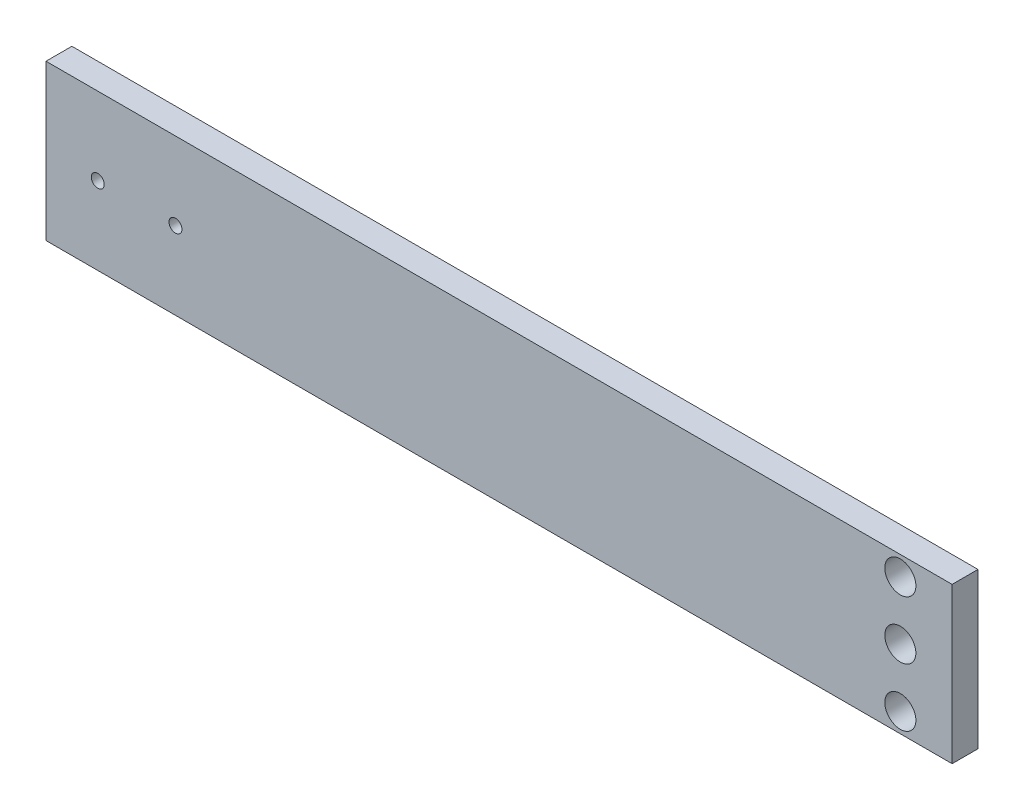
ISO-10303-21;
HEADER;
FILE_DESCRIPTION(('STEP AP214'),'2;1');
FILE_NAME('part.step','',(''),(''),'','','');
FILE_SCHEMA(('AUTOMOTIVE_DESIGN { 1 0 10303 214 1 1 1 1 }'));
ENDSEC;
DATA;
#1=APPLICATION_CONTEXT('core data for automotive mechanical design processes');
#2=APPLICATION_PROTOCOL_DEFINITION('international standard','automotive_design',2000,#1);
#3=PRODUCT_CONTEXT('',#1,'mechanical');
#4=PRODUCT('Part','Part','',(#3));
#5=PRODUCT_RELATED_PRODUCT_CATEGORY('part','',(#4));
#6=PRODUCT_DEFINITION_FORMATION('','',#4);
#7=PRODUCT_DEFINITION_CONTEXT('part definition',#1,'design');
#8=PRODUCT_DEFINITION('design','',#6,#7);
#9=PRODUCT_DEFINITION_SHAPE('','',#8);
#10=(LENGTH_UNIT() NAMED_UNIT(*) SI_UNIT(.MILLI.,.METRE.));
#11=(NAMED_UNIT(*) PLANE_ANGLE_UNIT() SI_UNIT($,.RADIAN.));
#12=(NAMED_UNIT(*) SI_UNIT($,.STERADIAN.) SOLID_ANGLE_UNIT());
#13=UNCERTAINTY_MEASURE_WITH_UNIT(LENGTH_MEASURE(1.E-05),#10,'distance_accuracy_value','');
#14=(GEOMETRIC_REPRESENTATION_CONTEXT(3) GLOBAL_UNCERTAINTY_ASSIGNED_CONTEXT((#13)) GLOBAL_UNIT_ASSIGNED_CONTEXT((#10,
#11,#12)) REPRESENTATION_CONTEXT('',''));
#15=CARTESIAN_POINT('',(0.,0.,0.));
#16=DIRECTION('',(0.,0.,1.));
#17=DIRECTION('',(1.,0.,0.));
#18=AXIS2_PLACEMENT_3D('',#15,#16,#17);
#19=CARTESIAN_POINT('',(175.,30.,10.));
#20=DIRECTION('',(-1.,0.,0.));
#21=DIRECTION('',(0.,0.,1.));
#22=AXIS2_PLACEMENT_3D('',#19,#20,#21);
#23=PLANE('',#22);
#24=DIRECTION('',(0.,1.,0.));
#25=VECTOR('',#24,1.);
#26=CARTESIAN_POINT('',(175.,30.,0.));
#27=LINE('',#26,#25);
#28=CARTESIAN_POINT('',(175.,-30.,0.));
#29=VERTEX_POINT('',#28);
#30=CARTESIAN_POINT('',(175.,30.,0.));
#31=VERTEX_POINT('',#30);
#32=EDGE_CURVE('E111',#29,#31,#27,.T.);
#33=ORIENTED_EDGE('',*,*,#32,.T.);
#34=DIRECTION('',(0.,0.,-1.));
#35=VECTOR('',#34,1.);
#36=CARTESIAN_POINT('',(175.,30.,10.));
#37=LINE('',#36,#35);
#38=CARTESIAN_POINT('',(175.,30.,10.));
#39=VERTEX_POINT('',#38);
#40=EDGE_CURVE('E11',#39,#31,#37,.T.);
#41=ORIENTED_EDGE('',*,*,#40,.F.);
#42=DIRECTION('',(0.,1.,0.));
#43=VECTOR('',#42,1.);
#44=CARTESIAN_POINT('',(175.,30.,10.));
#45=LINE('',#44,#43);
#46=CARTESIAN_POINT('',(175.,-30.,10.));
#47=VERTEX_POINT('',#46);
#48=EDGE_CURVE('E95',#47,#39,#45,.T.);
#49=ORIENTED_EDGE('',*,*,#48,.F.);
#50=DIRECTION('',(0.,0.,-1.));
#51=VECTOR('',#50,1.);
#52=CARTESIAN_POINT('',(175.,-30.,10.));
#53=LINE('',#52,#51);
#54=EDGE_CURVE('E107',#47,#29,#53,.T.);
#55=ORIENTED_EDGE('',*,*,#54,.T.);
#56=EDGE_LOOP('',(#33,#41,#49,#55));
#57=FACE_BOUND('',#56,.T.);
#58=ADVANCED_FACE('F43',(#57),#23,.F.);
#59=CARTESIAN_POINT('',(-175.,30.,10.));
#60=DIRECTION('',(0.,-1.,0.));
#61=DIRECTION('',(0.,0.,-1.));
#62=AXIS2_PLACEMENT_3D('',#59,#60,#61);
#63=PLANE('',#62);
#64=DIRECTION('',(-1.,0.,0.));
#65=VECTOR('',#64,1.);
#66=CARTESIAN_POINT('',(-175.,30.,0.));
#67=LINE('',#66,#65);
#68=CARTESIAN_POINT('',(-175.,30.,0.));
#69=VERTEX_POINT('',#68);
#70=EDGE_CURVE('E100',#31,#69,#67,.T.);
#71=ORIENTED_EDGE('',*,*,#70,.T.);
#72=DIRECTION('',(0.,0.,-1.));
#73=VECTOR('',#72,1.);
#74=CARTESIAN_POINT('',(-175.,30.,10.));
#75=LINE('',#74,#73);
#76=CARTESIAN_POINT('',(-175.,30.,10.));
#77=VERTEX_POINT('',#76);
#78=EDGE_CURVE('E52',#77,#69,#75,.T.);
#79=ORIENTED_EDGE('',*,*,#78,.F.);
#80=DIRECTION('',(-1.,0.,0.));
#81=VECTOR('',#80,1.);
#82=CARTESIAN_POINT('',(-175.,30.,10.));
#83=LINE('',#82,#81);
#84=EDGE_CURVE('E90',#39,#77,#83,.T.);
#85=ORIENTED_EDGE('',*,*,#84,.F.);
#86=ORIENTED_EDGE('',*,*,#40,.T.);
#87=EDGE_LOOP('',(#71,#79,#85,#86));
#88=FACE_BOUND('',#87,.T.);
#89=ADVANCED_FACE('F99',(#88),#63,.F.);
#90=CARTESIAN_POINT('',(-175.,30.,10.));
#91=DIRECTION('',(1.,0.,0.));
#92=DIRECTION('',(0.,0.,-1.));
#93=AXIS2_PLACEMENT_3D('',#90,#91,#92);
#94=PLANE('',#93);
#95=DIRECTION('',(0.,-1.,0.));
#96=VECTOR('',#95,1.);
#97=CARTESIAN_POINT('',(-175.,30.,0.));
#98=LINE('',#97,#96);
#99=CARTESIAN_POINT('',(-175.,-30.,0.));
#100=VERTEX_POINT('',#99);
#101=EDGE_CURVE('E77',#69,#100,#98,.T.);
#102=ORIENTED_EDGE('',*,*,#101,.T.);
#103=DIRECTION('',(0.,0.,-1.));
#104=VECTOR('',#103,1.);
#105=CARTESIAN_POINT('',(-175.,-30.,10.));
#106=LINE('',#105,#104);
#107=CARTESIAN_POINT('',(-175.,-30.,10.));
#108=VERTEX_POINT('',#107);
#109=EDGE_CURVE('E102',#108,#100,#106,.T.);
#110=ORIENTED_EDGE('',*,*,#109,.F.);
#111=DIRECTION('',(0.,-1.,0.));
#112=VECTOR('',#111,1.);
#113=CARTESIAN_POINT('',(-175.,30.,10.));
#114=LINE('',#113,#112);
#115=EDGE_CURVE('E93',#77,#108,#114,.T.);
#116=ORIENTED_EDGE('',*,*,#115,.F.);
#117=ORIENTED_EDGE('',*,*,#78,.T.);
#118=EDGE_LOOP('',(#102,#110,#116,#117));
#119=FACE_BOUND('',#118,.T.);
#120=ADVANCED_FACE('F103',(#119),#94,.F.);
#121=CARTESIAN_POINT('',(-175.,-30.,10.));
#122=DIRECTION('',(0.,1.,0.));
#123=DIRECTION('',(0.,0.,1.));
#124=AXIS2_PLACEMENT_3D('',#121,#122,#123);
#125=PLANE('',#124);
#126=DIRECTION('',(1.,0.,0.));
#127=VECTOR('',#126,1.);
#128=CARTESIAN_POINT('',(-175.,-30.,0.));
#129=LINE('',#128,#127);
#130=EDGE_CURVE('E83',#100,#29,#129,.T.);
#131=ORIENTED_EDGE('',*,*,#130,.T.);
#132=ORIENTED_EDGE('',*,*,#54,.F.);
#133=DIRECTION('',(1.,0.,0.));
#134=VECTOR('',#133,1.);
#135=CARTESIAN_POINT('',(-175.,-30.,10.));
#136=LINE('',#135,#134);
#137=EDGE_CURVE('E60',#108,#47,#136,.T.);
#138=ORIENTED_EDGE('',*,*,#137,.F.);
#139=ORIENTED_EDGE('',*,*,#109,.T.);
#140=EDGE_LOOP('',(#131,#132,#138,#139));
#141=FACE_BOUND('',#140,.T.);
#142=ADVANCED_FACE('F125',(#141),#125,.F.);
#143=CARTESIAN_POINT('',(0.,0.,10.));
#144=DIRECTION('',(0.,0.,1.));
#145=DIRECTION('',(1.,0.,0.));
#146=AXIS2_PLACEMENT_3D('',#143,#144,#145);
#147=PLANE('',#146);
#148=CARTESIAN_POINT('',(155.,-22.5,10.));
#149=DIRECTION('',(0.,0.,1.));
#150=DIRECTION('',(1.,0.,0.));
#151=AXIS2_PLACEMENT_3D('',#148,#149,#150);
#152=CIRCLE('',#151,6.00000000000001);
#153=CARTESIAN_POINT('',(161.,-22.5,10.));
#154=VERTEX_POINT('',#153);
#155=EDGE_CURVE('E167',#154,#154,#152,.T.);
#156=ORIENTED_EDGE('',*,*,#155,.F.);
#157=EDGE_LOOP('',(#156));
#158=FACE_BOUND('',#157,.T.);
#159=CARTESIAN_POINT('',(155.,0.,10.));
#160=DIRECTION('',(0.,0.,1.));
#161=DIRECTION('',(1.,0.,0.));
#162=AXIS2_PLACEMENT_3D('',#159,#160,#161);
#163=CIRCLE('',#162,6.00000000000001);
#164=CARTESIAN_POINT('',(161.,0.,10.));
#165=VERTEX_POINT('',#164);
#166=EDGE_CURVE('E159',#165,#165,#163,.T.);
#167=ORIENTED_EDGE('',*,*,#166,.F.);
#168=EDGE_LOOP('',(#167));
#169=FACE_BOUND('',#168,.T.);
#170=CARTESIAN_POINT('',(155.,22.5,10.));
#171=DIRECTION('',(0.,0.,1.));
#172=DIRECTION('',(1.,0.,0.));
#173=AXIS2_PLACEMENT_3D('',#170,#171,#172);
#174=CIRCLE('',#173,6.00000000000001);
#175=CARTESIAN_POINT('',(161.,22.5,10.));
#176=VERTEX_POINT('',#175);
#177=EDGE_CURVE('E151',#176,#176,#174,.T.);
#178=ORIENTED_EDGE('',*,*,#177,.F.);
#179=EDGE_LOOP('',(#178));
#180=FACE_BOUND('',#179,.T.);
#181=CARTESIAN_POINT('',(-155.,0.,10.));
#182=DIRECTION('',(0.,0.,1.));
#183=DIRECTION('',(1.,0.,0.));
#184=AXIS2_PLACEMENT_3D('',#181,#182,#183);
#185=CIRCLE('',#184,2.5);
#186=CARTESIAN_POINT('',(-152.5,0.,10.));
#187=VERTEX_POINT('',#186);
#188=EDGE_CURVE('E143',#187,#187,#185,.T.);
#189=ORIENTED_EDGE('',*,*,#188,.F.);
#190=EDGE_LOOP('',(#189));
#191=FACE_BOUND('',#190,.T.);
#192=CARTESIAN_POINT('',(-125.,0.,10.));
#193=DIRECTION('',(0.,0.,1.));
#194=DIRECTION('',(1.,0.,0.));
#195=AXIS2_PLACEMENT_3D('',#192,#193,#194);
#196=CIRCLE('',#195,2.5);
#197=CARTESIAN_POINT('',(-122.5,0.,10.));
#198=VERTEX_POINT('',#197);
#199=EDGE_CURVE('E135',#198,#198,#196,.T.);
#200=ORIENTED_EDGE('',*,*,#199,.F.);
#201=EDGE_LOOP('',(#200));
#202=FACE_BOUND('',#201,.T.);
#203=ORIENTED_EDGE('',*,*,#48,.T.);
#204=ORIENTED_EDGE('',*,*,#84,.T.);
#205=ORIENTED_EDGE('',*,*,#115,.T.);
#206=ORIENTED_EDGE('',*,*,#137,.T.);
#207=EDGE_LOOP('',(#203,#204,#205,#206));
#208=FACE_BOUND('',#207,.T.);
#209=ADVANCED_FACE('F91',(#158,#169,#180,#191,#202,#208),#147,.T.);
#210=CARTESIAN_POINT('',(0.,0.,0.));
#211=DIRECTION('',(0.,0.,1.));
#212=DIRECTION('',(1.,0.,0.));
#213=AXIS2_PLACEMENT_3D('',#210,#211,#212);
#214=PLANE('',#213);
#215=CARTESIAN_POINT('',(155.,-22.5,0.));
#216=DIRECTION('',(0.,0.,1.));
#217=DIRECTION('',(1.,0.,0.));
#218=AXIS2_PLACEMENT_3D('',#215,#216,#217);
#219=CIRCLE('',#218,6.00000000000001);
#220=CARTESIAN_POINT('',(161.,-22.5,0.));
#221=VERTEX_POINT('',#220);
#222=EDGE_CURVE('E163',#221,#221,#219,.T.);
#223=ORIENTED_EDGE('',*,*,#222,.T.);
#224=EDGE_LOOP('',(#223));
#225=FACE_BOUND('',#224,.T.);
#226=CARTESIAN_POINT('',(155.,0.,0.));
#227=DIRECTION('',(0.,0.,1.));
#228=DIRECTION('',(1.,0.,0.));
#229=AXIS2_PLACEMENT_3D('',#226,#227,#228);
#230=CIRCLE('',#229,6.00000000000001);
#231=CARTESIAN_POINT('',(161.,0.,0.));
#232=VERTEX_POINT('',#231);
#233=EDGE_CURVE('E155',#232,#232,#230,.T.);
#234=ORIENTED_EDGE('',*,*,#233,.T.);
#235=EDGE_LOOP('',(#234));
#236=FACE_BOUND('',#235,.T.);
#237=CARTESIAN_POINT('',(155.,22.5,0.));
#238=DIRECTION('',(0.,0.,1.));
#239=DIRECTION('',(1.,0.,0.));
#240=AXIS2_PLACEMENT_3D('',#237,#238,#239);
#241=CIRCLE('',#240,6.00000000000001);
#242=CARTESIAN_POINT('',(161.,22.5,0.));
#243=VERTEX_POINT('',#242);
#244=EDGE_CURVE('E147',#243,#243,#241,.T.);
#245=ORIENTED_EDGE('',*,*,#244,.T.);
#246=EDGE_LOOP('',(#245));
#247=FACE_BOUND('',#246,.T.);
#248=CARTESIAN_POINT('',(-155.,0.,0.));
#249=DIRECTION('',(0.,0.,1.));
#250=DIRECTION('',(1.,0.,0.));
#251=AXIS2_PLACEMENT_3D('',#248,#249,#250);
#252=CIRCLE('',#251,2.5);
#253=CARTESIAN_POINT('',(-152.5,0.,0.));
#254=VERTEX_POINT('',#253);
#255=EDGE_CURVE('E139',#254,#254,#252,.T.);
#256=ORIENTED_EDGE('',*,*,#255,.T.);
#257=EDGE_LOOP('',(#256));
#258=FACE_BOUND('',#257,.T.);
#259=CARTESIAN_POINT('',(-125.,0.,0.));
#260=DIRECTION('',(0.,0.,1.));
#261=DIRECTION('',(1.,0.,0.));
#262=AXIS2_PLACEMENT_3D('',#259,#260,#261);
#263=CIRCLE('',#262,2.5);
#264=CARTESIAN_POINT('',(-122.5,0.,0.));
#265=VERTEX_POINT('',#264);
#266=EDGE_CURVE('E115',#265,#265,#263,.T.);
#267=ORIENTED_EDGE('',*,*,#266,.T.);
#268=EDGE_LOOP('',(#267));
#269=FACE_BOUND('',#268,.T.);
#270=ORIENTED_EDGE('',*,*,#32,.F.);
#271=ORIENTED_EDGE('',*,*,#130,.F.);
#272=ORIENTED_EDGE('',*,*,#101,.F.);
#273=ORIENTED_EDGE('',*,*,#70,.F.);
#274=EDGE_LOOP('',(#270,#271,#272,#273));
#275=FACE_BOUND('',#274,.T.);
#276=ADVANCED_FACE('F128',(#225,#236,#247,#258,#269,#275),#214,.F.);
#277=CARTESIAN_POINT('',(-125.,0.,10.));
#278=DIRECTION('',(0.,0.,1.));
#279=DIRECTION('',(1.,0.,0.));
#280=AXIS2_PLACEMENT_3D('',#277,#278,#279);
#281=CYLINDRICAL_SURFACE('',#280,2.5);
#282=ORIENTED_EDGE('',*,*,#199,.T.);
#283=EDGE_LOOP('',(#282));
#284=FACE_BOUND('',#283,.T.);
#285=ORIENTED_EDGE('',*,*,#266,.F.);
#286=EDGE_LOOP('',(#285));
#287=FACE_BOUND('',#286,.T.);
#288=ADVANCED_FACE('F186',(#284,#287),#281,.F.);
#289=CARTESIAN_POINT('',(-155.,0.,10.));
#290=DIRECTION('',(0.,0.,1.));
#291=DIRECTION('',(1.,0.,0.));
#292=AXIS2_PLACEMENT_3D('',#289,#290,#291);
#293=CYLINDRICAL_SURFACE('',#292,2.5);
#294=ORIENTED_EDGE('',*,*,#188,.T.);
#295=EDGE_LOOP('',(#294));
#296=FACE_BOUND('',#295,.T.);
#297=ORIENTED_EDGE('',*,*,#255,.F.);
#298=EDGE_LOOP('',(#297));
#299=FACE_BOUND('',#298,.T.);
#300=ADVANCED_FACE('F189',(#296,#299),#293,.F.);
#301=CARTESIAN_POINT('',(155.,22.5,10.));
#302=DIRECTION('',(0.,0.,1.));
#303=DIRECTION('',(1.,0.,0.));
#304=AXIS2_PLACEMENT_3D('',#301,#302,#303);
#305=CYLINDRICAL_SURFACE('',#304,6.00000000000001);
#306=ORIENTED_EDGE('',*,*,#177,.T.);
#307=EDGE_LOOP('',(#306));
#308=FACE_BOUND('',#307,.T.);
#309=ORIENTED_EDGE('',*,*,#244,.F.);
#310=EDGE_LOOP('',(#309));
#311=FACE_BOUND('',#310,.T.);
#312=ADVANCED_FACE('F235',(#308,#311),#305,.F.);
#313=CARTESIAN_POINT('',(155.,0.,10.));
#314=DIRECTION('',(0.,0.,1.));
#315=DIRECTION('',(1.,0.,0.));
#316=AXIS2_PLACEMENT_3D('',#313,#314,#315);
#317=CYLINDRICAL_SURFACE('',#316,6.00000000000001);
#318=ORIENTED_EDGE('',*,*,#166,.T.);
#319=EDGE_LOOP('',(#318));
#320=FACE_BOUND('',#319,.T.);
#321=ORIENTED_EDGE('',*,*,#233,.F.);
#322=EDGE_LOOP('',(#321));
#323=FACE_BOUND('',#322,.T.);
#324=ADVANCED_FACE('F240',(#320,#323),#317,.F.);
#325=CARTESIAN_POINT('',(155.,-22.5,10.));
#326=DIRECTION('',(0.,0.,1.));
#327=DIRECTION('',(1.,0.,0.));
#328=AXIS2_PLACEMENT_3D('',#325,#326,#327);
#329=CYLINDRICAL_SURFACE('',#328,6.00000000000001);
#330=ORIENTED_EDGE('',*,*,#155,.T.);
#331=EDGE_LOOP('',(#330));
#332=FACE_BOUND('',#331,.T.);
#333=ORIENTED_EDGE('',*,*,#222,.F.);
#334=EDGE_LOOP('',(#333));
#335=FACE_BOUND('',#334,.T.);
#336=ADVANCED_FACE('F172',(#332,#335),#329,.F.);
#337=CLOSED_SHELL('',(#58,#89,#120,#142,#209,#276,#288,#300,#312,#324,#336));
#338=MANIFOLD_SOLID_BREP('B2',#337);
#339=ADVANCED_BREP_SHAPE_REPRESENTATION('',(#18,#338),#14);
#340=SHAPE_DEFINITION_REPRESENTATION(#9,#339);
ENDSEC;
END-ISO-10303-21;
